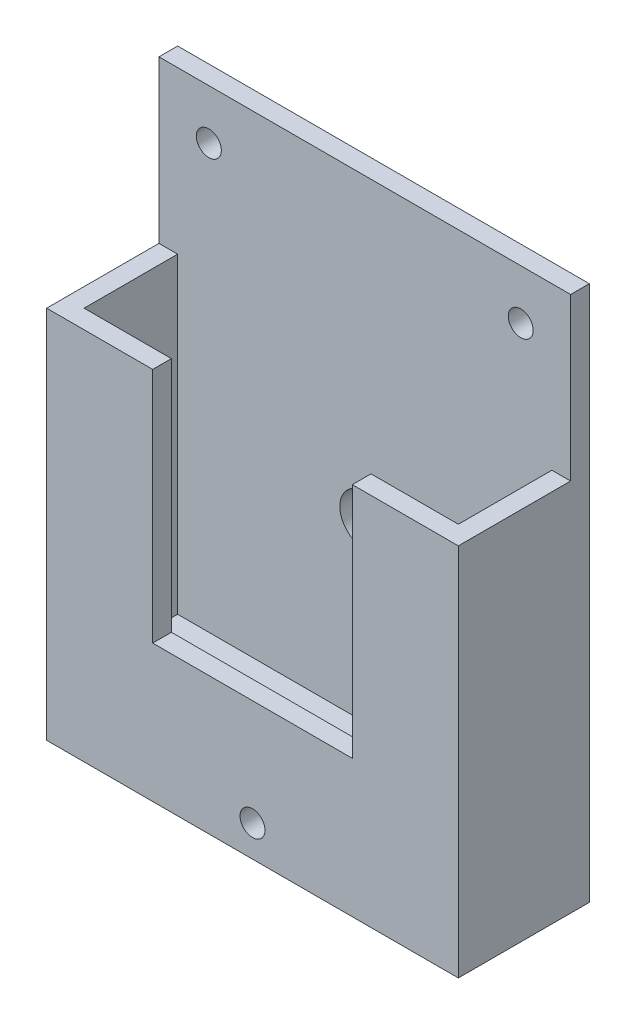
ISO-10303-21;
HEADER;
FILE_DESCRIPTION(('STEP AP214'),'2;1');
FILE_NAME('part.step','',(''),(''),'','','');
FILE_SCHEMA(('AUTOMOTIVE_DESIGN { 1 0 10303 214 1 1 1 1 }'));
ENDSEC;
DATA;
#1=APPLICATION_CONTEXT('core data for automotive mechanical design processes');
#2=APPLICATION_PROTOCOL_DEFINITION('international standard','automotive_design',2000,#1);
#3=PRODUCT_CONTEXT('',#1,'mechanical');
#4=PRODUCT('Part','Part','',(#3));
#5=PRODUCT_RELATED_PRODUCT_CATEGORY('part','',(#4));
#6=PRODUCT_DEFINITION_FORMATION('','',#4);
#7=PRODUCT_DEFINITION_CONTEXT('part definition',#1,'design');
#8=PRODUCT_DEFINITION('design','',#6,#7);
#9=PRODUCT_DEFINITION_SHAPE('','',#8);
#10=(LENGTH_UNIT() NAMED_UNIT(*) SI_UNIT(.MILLI.,.METRE.));
#11=(NAMED_UNIT(*) PLANE_ANGLE_UNIT() SI_UNIT($,.RADIAN.));
#12=(NAMED_UNIT(*) SI_UNIT($,.STERADIAN.) SOLID_ANGLE_UNIT());
#13=UNCERTAINTY_MEASURE_WITH_UNIT(LENGTH_MEASURE(1.E-05),#10,'distance_accuracy_value','');
#14=(GEOMETRIC_REPRESENTATION_CONTEXT(3) GLOBAL_UNCERTAINTY_ASSIGNED_CONTEXT((#13)) GLOBAL_UNIT_ASSIGNED_CONTEXT((#10,
#11,#12)) REPRESENTATION_CONTEXT('',''));
#15=CARTESIAN_POINT('',(0.,0.,0.));
#16=DIRECTION('',(0.,0.,1.));
#17=DIRECTION('',(1.,0.,0.));
#18=AXIS2_PLACEMENT_3D('',#15,#16,#17);
#19=CARTESIAN_POINT('',(-66.,-25.9,3.));
#20=DIRECTION('',(0.,1.,0.));
#21=DIRECTION('',(0.,0.,1.));
#22=AXIS2_PLACEMENT_3D('',#19,#20,#21);
#23=PLANE('',#22);
#24=DIRECTION('',(1.,0.,0.));
#25=VECTOR('',#24,1.);
#26=CARTESIAN_POINT('',(-66.,-25.9,21.));
#27=LINE('',#26,#25);
#28=CARTESIAN_POINT('',(-66.,-25.9,21.));
#29=VERTEX_POINT('',#28);
#30=CARTESIAN_POINT('',(-49.,-25.9,21.));
#31=VERTEX_POINT('',#30);
#32=EDGE_CURVE('E151',#29,#31,#27,.T.);
#33=ORIENTED_EDGE('',*,*,#32,.T.);
#34=DIRECTION('',(0.,0.,-1.));
#35=VECTOR('',#34,1.);
#36=CARTESIAN_POINT('',(-49.,-25.9,21.));
#37=LINE('',#36,#35);
#38=CARTESIAN_POINT('',(-49.,-25.9,18.));
#39=VERTEX_POINT('',#38);
#40=EDGE_CURVE('E133',#31,#39,#37,.T.);
#41=ORIENTED_EDGE('',*,*,#40,.T.);
#42=DIRECTION('',(1.,0.,0.));
#43=VECTOR('',#42,1.);
#44=CARTESIAN_POINT('',(-63.,-25.9,18.));
#45=LINE('',#44,#43);
#46=CARTESIAN_POINT('',(-63.,-25.9,18.));
#47=VERTEX_POINT('',#46);
#48=EDGE_CURVE('E249',#47,#39,#45,.T.);
#49=ORIENTED_EDGE('',*,*,#48,.F.);
#50=DIRECTION('',(0.,0.,1.));
#51=VECTOR('',#50,1.);
#52=CARTESIAN_POINT('',(-63.,-25.9,3.));
#53=LINE('',#52,#51);
#54=CARTESIAN_POINT('',(-63.,-25.9,3.));
#55=VERTEX_POINT('',#54);
#56=EDGE_CURVE('E258',#55,#47,#53,.T.);
#57=ORIENTED_EDGE('',*,*,#56,.F.);
#58=DIRECTION('',(1.,0.,0.));
#59=VECTOR('',#58,1.);
#60=CARTESIAN_POINT('',(-66.,-25.9,3.));
#61=LINE('',#60,#59);
#62=CARTESIAN_POINT('',(-66.,-25.9,3.));
#63=VERTEX_POINT('',#62);
#64=EDGE_CURVE('E164',#63,#55,#61,.T.);
#65=ORIENTED_EDGE('',*,*,#64,.F.);
#66=DIRECTION('',(0.,0.,1.));
#67=VECTOR('',#66,1.);
#68=CARTESIAN_POINT('',(-66.,-25.9,3.));
#69=LINE('',#68,#67);
#70=EDGE_CURVE('E158',#63,#29,#69,.T.);
#71=ORIENTED_EDGE('',*,*,#70,.T.);
#72=EDGE_LOOP('',(#33,#41,#49,#57,#65,#71));
#73=FACE_BOUND('',#72,.T.);
#74=ADVANCED_FACE('F32',(#73),#23,.T.);
#75=CARTESIAN_POINT('',(-17.,-25.9,18.));
#76=VERTEX_POINT('',#75);
#77=CARTESIAN_POINT('',(-3.,-25.9,18.));
#78=VERTEX_POINT('',#77);
#79=EDGE_CURVE('E272',#76,#78,#45,.T.);
#80=ORIENTED_EDGE('',*,*,#79,.F.);
#81=DIRECTION('',(0.,0.,-1.));
#82=VECTOR('',#81,1.);
#83=CARTESIAN_POINT('',(-17.,-25.9,21.));
#84=LINE('',#83,#82);
#85=CARTESIAN_POINT('',(-17.,-25.9,21.));
#86=VERTEX_POINT('',#85);
#87=EDGE_CURVE('E49',#86,#76,#84,.T.);
#88=ORIENTED_EDGE('',*,*,#87,.F.);
#89=CARTESIAN_POINT('',(0.,-25.9,21.));
#90=VERTEX_POINT('',#89);
#91=EDGE_CURVE('E160',#86,#90,#27,.T.);
#92=ORIENTED_EDGE('',*,*,#91,.T.);
#93=DIRECTION('',(0.,0.,1.));
#94=VECTOR('',#93,1.);
#95=CARTESIAN_POINT('',(0.,-25.9,3.));
#96=LINE('',#95,#94);
#97=CARTESIAN_POINT('',(0.,-25.9,3.));
#98=VERTEX_POINT('',#97);
#99=EDGE_CURVE('E207',#98,#90,#96,.T.);
#100=ORIENTED_EDGE('',*,*,#99,.F.);
#101=CARTESIAN_POINT('',(-3.,-25.9,3.));
#102=VERTEX_POINT('',#101);
#103=EDGE_CURVE('E169',#102,#98,#61,.T.);
#104=ORIENTED_EDGE('',*,*,#103,.F.);
#105=DIRECTION('',(0.,0.,1.));
#106=VECTOR('',#105,1.);
#107=CARTESIAN_POINT('',(-3.,-25.9,3.));
#108=LINE('',#107,#106);
#109=EDGE_CURVE('E144',#102,#78,#108,.T.);
#110=ORIENTED_EDGE('',*,*,#109,.T.);
#111=EDGE_LOOP('',(#80,#88,#92,#100,#104,#110));
#112=FACE_BOUND('',#111,.T.);
#113=ADVANCED_FACE('F290',(#112),#23,.T.);
#114=CARTESIAN_POINT('',(-66.,-25.9,21.));
#115=DIRECTION('',(0.,0.,1.));
#116=DIRECTION('',(0.,-1.,0.));
#117=AXIS2_PLACEMENT_3D('',#114,#115,#116);
#118=PLANE('',#117);
#119=CARTESIAN_POINT('',(-33.,-80.9,21.));
#120=DIRECTION('',(0.,0.,-1.));
#121=DIRECTION('',(-1.,0.,0.));
#122=AXIS2_PLACEMENT_3D('',#119,#120,#121);
#123=CIRCLE('',#122,2.);
#124=CARTESIAN_POINT('',(-35.,-80.9,21.));
#125=VERTEX_POINT('',#124);
#126=EDGE_CURVE('E421',#125,#125,#123,.T.);
#127=ORIENTED_EDGE('',*,*,#126,.T.);
#128=EDGE_LOOP('',(#127));
#129=FACE_BOUND('',#128,.T.);
#130=DIRECTION('',(1.,0.,0.));
#131=VECTOR('',#130,1.);
#132=CARTESIAN_POINT('',(-49.,-63.9,21.));
#133=LINE('',#132,#131);
#134=CARTESIAN_POINT('',(-49.,-63.9,21.));
#135=VERTEX_POINT('',#134);
#136=CARTESIAN_POINT('',(-17.,-63.9,21.));
#137=VERTEX_POINT('',#136);
#138=EDGE_CURVE('E154',#135,#137,#133,.T.);
#139=ORIENTED_EDGE('',*,*,#138,.F.);
#140=DIRECTION('',(0.,-1.,0.));
#141=VECTOR('',#140,1.);
#142=CARTESIAN_POINT('',(-49.,-25.9,21.));
#143=LINE('',#142,#141);
#144=EDGE_CURVE('E137',#31,#135,#143,.T.);
#145=ORIENTED_EDGE('',*,*,#144,.F.);
#146=ORIENTED_EDGE('',*,*,#32,.F.);
#147=DIRECTION('',(0.,-1.,0.));
#148=VECTOR('',#147,1.);
#149=CARTESIAN_POINT('',(-66.,-25.9,21.));
#150=LINE('',#149,#148);
#151=CARTESIAN_POINT('',(-66.,-85.9,21.));
#152=VERTEX_POINT('',#151);
#153=EDGE_CURVE('E253',#29,#152,#150,.T.);
#154=ORIENTED_EDGE('',*,*,#153,.T.);
#155=DIRECTION('',(1.,0.,0.));
#156=VECTOR('',#155,1.);
#157=CARTESIAN_POINT('',(-66.,-85.9,21.));
#158=LINE('',#157,#156);
#159=CARTESIAN_POINT('',(0.,-85.9,21.));
#160=VERTEX_POINT('',#159);
#161=EDGE_CURVE('E159',#152,#160,#158,.T.);
#162=ORIENTED_EDGE('',*,*,#161,.T.);
#163=DIRECTION('',(0.,-1.,0.));
#164=VECTOR('',#163,1.);
#165=CARTESIAN_POINT('',(0.,-25.9,21.));
#166=LINE('',#165,#164);
#167=EDGE_CURVE('E225',#90,#160,#166,.T.);
#168=ORIENTED_EDGE('',*,*,#167,.F.);
#169=ORIENTED_EDGE('',*,*,#91,.F.);
#170=DIRECTION('',(0.,1.,0.));
#171=VECTOR('',#170,1.);
#172=CARTESIAN_POINT('',(-17.,-63.9,21.));
#173=LINE('',#172,#171);
#174=EDGE_CURVE('E292',#137,#86,#173,.T.);
#175=ORIENTED_EDGE('',*,*,#174,.F.);
#176=EDGE_LOOP('',(#139,#145,#146,#154,#162,#168,#169,#175));
#177=FACE_BOUND('',#176,.T.);
#178=ADVANCED_FACE('F149',(#129,#177),#118,.T.);
#179=CARTESIAN_POINT('',(-63.,-25.9,18.));
#180=DIRECTION('',(0.,0.,1.));
#181=DIRECTION('',(0.,-1.,0.));
#182=AXIS2_PLACEMENT_3D('',#179,#180,#181);
#183=PLANE('',#182);
#184=DIRECTION('',(0.,1.,0.));
#185=VECTOR('',#184,1.);
#186=CARTESIAN_POINT('',(-49.,-25.9,18.));
#187=LINE('',#186,#185);
#188=CARTESIAN_POINT('',(-49.,-63.9,18.));
#189=VERTEX_POINT('',#188);
#190=EDGE_CURVE('E11',#189,#39,#187,.T.);
#191=ORIENTED_EDGE('',*,*,#190,.F.);
#192=DIRECTION('',(-1.,0.,0.));
#193=VECTOR('',#192,1.);
#194=CARTESIAN_POINT('',(-63.,-63.9,18.));
#195=LINE('',#194,#193);
#196=CARTESIAN_POINT('',(-17.,-63.9,18.));
#197=VERTEX_POINT('',#196);
#198=EDGE_CURVE('E41',#197,#189,#195,.T.);
#199=ORIENTED_EDGE('',*,*,#198,.F.);
#200=DIRECTION('',(0.,-1.,0.));
#201=VECTOR('',#200,1.);
#202=CARTESIAN_POINT('',(-17.,-25.9,18.));
#203=LINE('',#202,#201);
#204=EDGE_CURVE('E173',#76,#197,#203,.T.);
#205=ORIENTED_EDGE('',*,*,#204,.F.);
#206=ORIENTED_EDGE('',*,*,#79,.T.);
#207=DIRECTION('',(0.,-1.,0.));
#208=VECTOR('',#207,1.);
#209=CARTESIAN_POINT('',(-3.,-25.9,18.));
#210=LINE('',#209,#208);
#211=CARTESIAN_POINT('',(-3.,-75.9,18.));
#212=VERTEX_POINT('',#211);
#213=EDGE_CURVE('E275',#78,#212,#210,.T.);
#214=ORIENTED_EDGE('',*,*,#213,.T.);
#215=DIRECTION('',(1.,0.,0.));
#216=VECTOR('',#215,1.);
#217=CARTESIAN_POINT('',(-63.,-75.9,18.));
#218=LINE('',#217,#216);
#219=CARTESIAN_POINT('',(-63.,-75.9,18.));
#220=VERTEX_POINT('',#219);
#221=EDGE_CURVE('E219',#220,#212,#218,.T.);
#222=ORIENTED_EDGE('',*,*,#221,.F.);
#223=DIRECTION('',(0.,-1.,0.));
#224=VECTOR('',#223,1.);
#225=CARTESIAN_POINT('',(-63.,-25.9,18.));
#226=LINE('',#225,#224);
#227=EDGE_CURVE('E261',#47,#220,#226,.T.);
#228=ORIENTED_EDGE('',*,*,#227,.F.);
#229=ORIENTED_EDGE('',*,*,#48,.T.);
#230=EDGE_LOOP('',(#191,#199,#205,#206,#214,#222,#228,#229));
#231=FACE_BOUND('',#230,.T.);
#232=ADVANCED_FACE('F285',(#231),#183,.F.);
#233=CARTESIAN_POINT('',(-66.,0.,3.));
#234=DIRECTION('',(0.,1.,0.));
#235=DIRECTION('',(0.,0.,1.));
#236=AXIS2_PLACEMENT_3D('',#233,#234,#235);
#237=PLANE('',#236);
#238=DIRECTION('',(0.,0.,1.));
#239=VECTOR('',#238,1.);
#240=CARTESIAN_POINT('',(0.,0.,3.));
#241=LINE('',#240,#239);
#242=CARTESIAN_POINT('',(0.,0.,0.));
#243=VERTEX_POINT('',#242);
#244=CARTESIAN_POINT('',(0.,0.,3.));
#245=VERTEX_POINT('',#244);
#246=EDGE_CURVE('E208',#243,#245,#241,.T.);
#247=ORIENTED_EDGE('',*,*,#246,.F.);
#248=DIRECTION('',(1.,0.,0.));
#249=VECTOR('',#248,1.);
#250=CARTESIAN_POINT('',(-66.,0.,0.));
#251=LINE('',#250,#249);
#252=CARTESIAN_POINT('',(-66.,0.,0.));
#253=VERTEX_POINT('',#252);
#254=EDGE_CURVE('E175',#253,#243,#251,.T.);
#255=ORIENTED_EDGE('',*,*,#254,.F.);
#256=DIRECTION('',(0.,0.,1.));
#257=VECTOR('',#256,1.);
#258=CARTESIAN_POINT('',(-66.,0.,3.));
#259=LINE('',#258,#257);
#260=CARTESIAN_POINT('',(-66.,0.,3.));
#261=VERTEX_POINT('',#260);
#262=EDGE_CURVE('E231',#253,#261,#259,.T.);
#263=ORIENTED_EDGE('',*,*,#262,.T.);
#264=DIRECTION('',(1.,0.,0.));
#265=VECTOR('',#264,1.);
#266=CARTESIAN_POINT('',(-66.,0.,3.));
#267=LINE('',#266,#265);
#268=EDGE_CURVE('E170',#261,#245,#267,.T.);
#269=ORIENTED_EDGE('',*,*,#268,.T.);
#270=EDGE_LOOP('',(#247,#255,#263,#269));
#271=FACE_BOUND('',#270,.T.);
#272=ADVANCED_FACE('F34',(#271),#237,.T.);
#273=CARTESIAN_POINT('',(-66.,-85.9,0.));
#274=DIRECTION('',(0.,0.,-1.));
#275=DIRECTION('',(-1.,0.,0.));
#276=AXIS2_PLACEMENT_3D('',#273,#274,#275);
#277=PLANE('',#276);
#278=CARTESIAN_POINT('',(-8.,-8.00000000000001,0.));
#279=DIRECTION('',(0.,0.,-1.));
#280=DIRECTION('',(-1.,0.,0.));
#281=AXIS2_PLACEMENT_3D('',#278,#279,#280);
#282=CIRCLE('',#281,2.);
#283=CARTESIAN_POINT('',(-10.,-8.00000000000001,0.));
#284=VERTEX_POINT('',#283);
#285=EDGE_CURVE('E430',#284,#284,#282,.T.);
#286=ORIENTED_EDGE('',*,*,#285,.F.);
#287=EDGE_LOOP('',(#286));
#288=FACE_BOUND('',#287,.T.);
#289=CARTESIAN_POINT('',(-58.,-7.99999999999999,0.));
#290=DIRECTION('',(0.,0.,-1.));
#291=DIRECTION('',(-1.,0.,0.));
#292=AXIS2_PLACEMENT_3D('',#289,#290,#291);
#293=CIRCLE('',#292,2.);
#294=CARTESIAN_POINT('',(-60.,-7.99999999999999,0.));
#295=VERTEX_POINT('',#294);
#296=EDGE_CURVE('E426',#295,#295,#293,.T.);
#297=ORIENTED_EDGE('',*,*,#296,.F.);
#298=EDGE_LOOP('',(#297));
#299=FACE_BOUND('',#298,.T.);
#300=CARTESIAN_POINT('',(-33.,-80.9,0.));
#301=DIRECTION('',(0.,0.,-1.));
#302=DIRECTION('',(-1.,0.,0.));
#303=AXIS2_PLACEMENT_3D('',#300,#301,#302);
#304=CIRCLE('',#303,2.);
#305=CARTESIAN_POINT('',(-35.,-80.9,0.));
#306=VERTEX_POINT('',#305);
#307=EDGE_CURVE('E424',#306,#306,#304,.T.);
#308=ORIENTED_EDGE('',*,*,#307,.F.);
#309=EDGE_LOOP('',(#308));
#310=FACE_BOUND('',#309,.T.);
#311=CARTESIAN_POINT('',(-33.,-47.9,0.));
#312=DIRECTION('',(0.,0.,-1.));
#313=DIRECTION('',(-1.,0.,0.));
#314=AXIS2_PLACEMENT_3D('',#311,#312,#313);
#315=CIRCLE('',#314,4.);
#316=CARTESIAN_POINT('',(-37.,-47.9,0.));
#317=VERTEX_POINT('',#316);
#318=EDGE_CURVE('E180',#317,#317,#315,.T.);
#319=ORIENTED_EDGE('',*,*,#318,.F.);
#320=EDGE_LOOP('',(#319));
#321=FACE_BOUND('',#320,.T.);
#322=DIRECTION('',(0.,1.,0.));
#323=VECTOR('',#322,1.);
#324=CARTESIAN_POINT('',(0.,-85.9,0.));
#325=LINE('',#324,#323);
#326=CARTESIAN_POINT('',(0.,-85.9,0.));
#327=VERTEX_POINT('',#326);
#328=EDGE_CURVE('E215',#327,#243,#325,.T.);
#329=ORIENTED_EDGE('',*,*,#328,.F.);
#330=DIRECTION('',(1.,0.,0.));
#331=VECTOR('',#330,1.);
#332=CARTESIAN_POINT('',(-66.,-85.9,0.));
#333=LINE('',#332,#331);
#334=CARTESIAN_POINT('',(-66.,-85.9,0.));
#335=VERTEX_POINT('',#334);
#336=EDGE_CURVE('E162',#335,#327,#333,.T.);
#337=ORIENTED_EDGE('',*,*,#336,.F.);
#338=DIRECTION('',(0.,1.,0.));
#339=VECTOR('',#338,1.);
#340=CARTESIAN_POINT('',(-66.,-85.9,0.));
#341=LINE('',#340,#339);
#342=EDGE_CURVE('E172',#335,#253,#341,.T.);
#343=ORIENTED_EDGE('',*,*,#342,.T.);
#344=ORIENTED_EDGE('',*,*,#254,.T.);
#345=EDGE_LOOP('',(#329,#337,#343,#344));
#346=FACE_BOUND('',#345,.T.);
#347=ADVANCED_FACE('F241',(#288,#299,#310,#321,#346),#277,.T.);
#348=CARTESIAN_POINT('',(-66.,-85.9,21.));
#349=DIRECTION('',(0.,-1.,0.));
#350=DIRECTION('',(0.,0.,-1.));
#351=AXIS2_PLACEMENT_3D('',#348,#349,#350);
#352=PLANE('',#351);
#353=DIRECTION('',(0.,0.,-1.));
#354=VECTOR('',#353,1.);
#355=CARTESIAN_POINT('',(0.,-85.9,21.));
#356=LINE('',#355,#354);
#357=EDGE_CURVE('E228',#160,#327,#356,.T.);
#358=ORIENTED_EDGE('',*,*,#357,.F.);
#359=ORIENTED_EDGE('',*,*,#161,.F.);
#360=DIRECTION('',(0.,0.,-1.));
#361=VECTOR('',#360,1.);
#362=CARTESIAN_POINT('',(-66.,-85.9,21.));
#363=LINE('',#362,#361);
#364=EDGE_CURVE('E236',#152,#335,#363,.T.);
#365=ORIENTED_EDGE('',*,*,#364,.T.);
#366=ORIENTED_EDGE('',*,*,#336,.T.);
#367=EDGE_LOOP('',(#358,#359,#365,#366));
#368=FACE_BOUND('',#367,.T.);
#369=ADVANCED_FACE('F194',(#368),#352,.T.);
#370=CARTESIAN_POINT('',(-66.,-25.9,3.));
#371=DIRECTION('',(0.,0.,1.));
#372=DIRECTION('',(1.,0.,0.));
#373=AXIS2_PLACEMENT_3D('',#370,#371,#372);
#374=PLANE('',#373);
#375=CARTESIAN_POINT('',(-8.,-8.00000000000001,3.));
#376=DIRECTION('',(0.,0.,1.));
#377=DIRECTION('',(1.,0.,0.));
#378=AXIS2_PLACEMENT_3D('',#375,#376,#377);
#379=CIRCLE('',#378,2.);
#380=CARTESIAN_POINT('',(-6.,-8.00000000000001,3.));
#381=VERTEX_POINT('',#380);
#382=EDGE_CURVE('E36',#381,#381,#379,.T.);
#383=ORIENTED_EDGE('',*,*,#382,.F.);
#384=EDGE_LOOP('',(#383));
#385=FACE_BOUND('',#384,.T.);
#386=CARTESIAN_POINT('',(-58.,-7.99999999999999,3.));
#387=DIRECTION('',(0.,0.,1.));
#388=DIRECTION('',(1.,0.,0.));
#389=AXIS2_PLACEMENT_3D('',#386,#387,#388);
#390=CIRCLE('',#389,2.);
#391=CARTESIAN_POINT('',(-56.,-7.99999999999999,3.));
#392=VERTEX_POINT('',#391);
#393=EDGE_CURVE('E179',#392,#392,#390,.T.);
#394=ORIENTED_EDGE('',*,*,#393,.F.);
#395=EDGE_LOOP('',(#394));
#396=FACE_BOUND('',#395,.T.);
#397=CARTESIAN_POINT('',(-33.,-47.9,3.));
#398=DIRECTION('',(0.,0.,1.));
#399=DIRECTION('',(1.,0.,0.));
#400=AXIS2_PLACEMENT_3D('',#397,#398,#399);
#401=CIRCLE('',#400,4.);
#402=CARTESIAN_POINT('',(-29.,-47.9,3.));
#403=VERTEX_POINT('',#402);
#404=EDGE_CURVE('E177',#403,#403,#401,.T.);
#405=ORIENTED_EDGE('',*,*,#404,.F.);
#406=EDGE_LOOP('',(#405));
#407=FACE_BOUND('',#406,.T.);
#408=DIRECTION('',(0.,-1.,0.));
#409=VECTOR('',#408,1.);
#410=CARTESIAN_POINT('',(0.,-25.9,3.));
#411=LINE('',#410,#409);
#412=EDGE_CURVE('E199',#245,#98,#411,.T.);
#413=ORIENTED_EDGE('',*,*,#412,.F.);
#414=ORIENTED_EDGE('',*,*,#268,.F.);
#415=DIRECTION('',(0.,-1.,0.));
#416=VECTOR('',#415,1.);
#417=CARTESIAN_POINT('',(-66.,-25.9,3.));
#418=LINE('',#417,#416);
#419=EDGE_CURVE('E245',#261,#63,#418,.T.);
#420=ORIENTED_EDGE('',*,*,#419,.T.);
#421=ORIENTED_EDGE('',*,*,#64,.T.);
#422=DIRECTION('',(0.,1.,0.));
#423=VECTOR('',#422,1.);
#424=CARTESIAN_POINT('',(-63.,-75.9,3.));
#425=LINE('',#424,#423);
#426=CARTESIAN_POINT('',(-63.,-75.9,3.));
#427=VERTEX_POINT('',#426);
#428=EDGE_CURVE('E255',#427,#55,#425,.T.);
#429=ORIENTED_EDGE('',*,*,#428,.F.);
#430=DIRECTION('',(1.,0.,0.));
#431=VECTOR('',#430,1.);
#432=CARTESIAN_POINT('',(-63.,-75.9,3.));
#433=LINE('',#432,#431);
#434=CARTESIAN_POINT('',(-3.,-75.9,3.));
#435=VERTEX_POINT('',#434);
#436=EDGE_CURVE('E217',#427,#435,#433,.T.);
#437=ORIENTED_EDGE('',*,*,#436,.T.);
#438=DIRECTION('',(0.,1.,0.));
#439=VECTOR('',#438,1.);
#440=CARTESIAN_POINT('',(-3.,-75.9,3.));
#441=LINE('',#440,#439);
#442=EDGE_CURVE('E57',#435,#102,#441,.T.);
#443=ORIENTED_EDGE('',*,*,#442,.T.);
#444=ORIENTED_EDGE('',*,*,#103,.T.);
#445=EDGE_LOOP('',(#413,#414,#420,#421,#429,#437,#443,#444));
#446=FACE_BOUND('',#445,.T.);
#447=ADVANCED_FACE('F190',(#385,#396,#407,#446),#374,.T.);
#448=CARTESIAN_POINT('',(-66.,0.,0.));
#449=DIRECTION('',(1.,0.,0.));
#450=DIRECTION('',(0.,0.,-1.));
#451=AXIS2_PLACEMENT_3D('',#448,#449,#450);
#452=PLANE('',#451);
#453=ORIENTED_EDGE('',*,*,#262,.F.);
#454=ORIENTED_EDGE('',*,*,#342,.F.);
#455=ORIENTED_EDGE('',*,*,#364,.F.);
#456=ORIENTED_EDGE('',*,*,#153,.F.);
#457=ORIENTED_EDGE('',*,*,#70,.F.);
#458=ORIENTED_EDGE('',*,*,#419,.F.);
#459=EDGE_LOOP('',(#453,#454,#455,#456,#457,#458));
#460=FACE_BOUND('',#459,.T.);
#461=ADVANCED_FACE('F193',(#460),#452,.F.);
#462=CARTESIAN_POINT('',(0.,0.,0.));
#463=DIRECTION('',(1.,0.,0.));
#464=DIRECTION('',(0.,0.,-1.));
#465=AXIS2_PLACEMENT_3D('',#462,#463,#464);
#466=PLANE('',#465);
#467=ORIENTED_EDGE('',*,*,#246,.T.);
#468=ORIENTED_EDGE('',*,*,#412,.T.);
#469=ORIENTED_EDGE('',*,*,#99,.T.);
#470=ORIENTED_EDGE('',*,*,#167,.T.);
#471=ORIENTED_EDGE('',*,*,#357,.T.);
#472=ORIENTED_EDGE('',*,*,#328,.T.);
#473=EDGE_LOOP('',(#467,#468,#469,#470,#471,#472));
#474=FACE_BOUND('',#473,.T.);
#475=ADVANCED_FACE('F212',(#474),#466,.T.);
#476=CARTESIAN_POINT('',(-63.,-75.9,18.));
#477=DIRECTION('',(0.,-1.,0.));
#478=DIRECTION('',(0.,0.,-1.));
#479=AXIS2_PLACEMENT_3D('',#476,#477,#478);
#480=PLANE('',#479);
#481=DIRECTION('',(0.,0.,-1.));
#482=VECTOR('',#481,1.);
#483=CARTESIAN_POINT('',(-3.,-75.9,18.));
#484=LINE('',#483,#482);
#485=EDGE_CURVE('E265',#212,#435,#484,.T.);
#486=ORIENTED_EDGE('',*,*,#485,.T.);
#487=ORIENTED_EDGE('',*,*,#436,.F.);
#488=DIRECTION('',(0.,0.,-1.));
#489=VECTOR('',#488,1.);
#490=CARTESIAN_POINT('',(-63.,-75.9,18.));
#491=LINE('',#490,#489);
#492=EDGE_CURVE('E263',#220,#427,#491,.T.);
#493=ORIENTED_EDGE('',*,*,#492,.F.);
#494=ORIENTED_EDGE('',*,*,#221,.T.);
#495=EDGE_LOOP('',(#486,#487,#493,#494));
#496=FACE_BOUND('',#495,.T.);
#497=ADVANCED_FACE('F330',(#496),#480,.F.);
#498=CARTESIAN_POINT('',(-63.,0.,0.));
#499=DIRECTION('',(1.,0.,0.));
#500=DIRECTION('',(0.,0.,-1.));
#501=AXIS2_PLACEMENT_3D('',#498,#499,#500);
#502=PLANE('',#501);
#503=ORIENTED_EDGE('',*,*,#56,.T.);
#504=ORIENTED_EDGE('',*,*,#227,.T.);
#505=ORIENTED_EDGE('',*,*,#492,.T.);
#506=ORIENTED_EDGE('',*,*,#428,.T.);
#507=EDGE_LOOP('',(#503,#504,#505,#506));
#508=FACE_BOUND('',#507,.T.);
#509=ADVANCED_FACE('F337',(#508),#502,.T.);
#510=CARTESIAN_POINT('',(-3.,0.,0.));
#511=DIRECTION('',(1.,0.,0.));
#512=DIRECTION('',(0.,0.,-1.));
#513=AXIS2_PLACEMENT_3D('',#510,#511,#512);
#514=PLANE('',#513);
#515=ORIENTED_EDGE('',*,*,#109,.F.);
#516=ORIENTED_EDGE('',*,*,#442,.F.);
#517=ORIENTED_EDGE('',*,*,#485,.F.);
#518=ORIENTED_EDGE('',*,*,#213,.F.);
#519=EDGE_LOOP('',(#515,#516,#517,#518));
#520=FACE_BOUND('',#519,.T.);
#521=ADVANCED_FACE('F289',(#520),#514,.F.);
#522=CARTESIAN_POINT('',(-49.,-25.9,21.));
#523=DIRECTION('',(1.,0.,0.));
#524=DIRECTION('',(0.,1.,0.));
#525=AXIS2_PLACEMENT_3D('',#522,#523,#524);
#526=PLANE('',#525);
#527=ORIENTED_EDGE('',*,*,#190,.T.);
#528=ORIENTED_EDGE('',*,*,#40,.F.);
#529=ORIENTED_EDGE('',*,*,#144,.T.);
#530=DIRECTION('',(0.,0.,-1.));
#531=VECTOR('',#530,1.);
#532=CARTESIAN_POINT('',(-49.,-63.9,21.));
#533=LINE('',#532,#531);
#534=EDGE_CURVE('E145',#135,#189,#533,.T.);
#535=ORIENTED_EDGE('',*,*,#534,.T.);
#536=EDGE_LOOP('',(#527,#528,#529,#535));
#537=FACE_BOUND('',#536,.T.);
#538=ADVANCED_FACE('F135',(#537),#526,.T.);
#539=CARTESIAN_POINT('',(-49.,-63.9,21.));
#540=DIRECTION('',(0.,1.,0.));
#541=DIRECTION('',(0.,0.,1.));
#542=AXIS2_PLACEMENT_3D('',#539,#540,#541);
#543=PLANE('',#542);
#544=ORIENTED_EDGE('',*,*,#198,.T.);
#545=ORIENTED_EDGE('',*,*,#534,.F.);
#546=ORIENTED_EDGE('',*,*,#138,.T.);
#547=DIRECTION('',(0.,0.,-1.));
#548=VECTOR('',#547,1.);
#549=CARTESIAN_POINT('',(-17.,-63.9,21.));
#550=LINE('',#549,#548);
#551=EDGE_CURVE('E295',#137,#197,#550,.T.);
#552=ORIENTED_EDGE('',*,*,#551,.T.);
#553=EDGE_LOOP('',(#544,#545,#546,#552));
#554=FACE_BOUND('',#553,.T.);
#555=ADVANCED_FACE('F301',(#554),#543,.T.);
#556=CARTESIAN_POINT('',(-17.,-63.9,21.));
#557=DIRECTION('',(-1.,0.,0.));
#558=DIRECTION('',(0.,0.,1.));
#559=AXIS2_PLACEMENT_3D('',#556,#557,#558);
#560=PLANE('',#559);
#561=ORIENTED_EDGE('',*,*,#204,.T.);
#562=ORIENTED_EDGE('',*,*,#551,.F.);
#563=ORIENTED_EDGE('',*,*,#174,.T.);
#564=ORIENTED_EDGE('',*,*,#87,.T.);
#565=EDGE_LOOP('',(#561,#562,#563,#564));
#566=FACE_BOUND('',#565,.T.);
#567=ADVANCED_FACE('F302',(#566),#560,.T.);
#568=CARTESIAN_POINT('',(-33.,-47.9,21.));
#569=DIRECTION('',(0.,0.,-1.));
#570=DIRECTION('',(-1.,0.,0.));
#571=AXIS2_PLACEMENT_3D('',#568,#569,#570);
#572=CYLINDRICAL_SURFACE('',#571,4.);
#573=ORIENTED_EDGE('',*,*,#404,.T.);
#574=EDGE_LOOP('',(#573));
#575=FACE_BOUND('',#574,.T.);
#576=ORIENTED_EDGE('',*,*,#318,.T.);
#577=EDGE_LOOP('',(#576));
#578=FACE_BOUND('',#577,.T.);
#579=ADVANCED_FACE('F304',(#575,#578),#572,.F.);
#580=CARTESIAN_POINT('',(-58.,-7.99999999999999,21.));
#581=DIRECTION('',(0.,0.,-1.));
#582=DIRECTION('',(-1.,0.,0.));
#583=AXIS2_PLACEMENT_3D('',#580,#581,#582);
#584=CYLINDRICAL_SURFACE('',#583,2.);
#585=ORIENTED_EDGE('',*,*,#393,.T.);
#586=EDGE_LOOP('',(#585));
#587=FACE_BOUND('',#586,.T.);
#588=ORIENTED_EDGE('',*,*,#296,.T.);
#589=EDGE_LOOP('',(#588));
#590=FACE_BOUND('',#589,.T.);
#591=ADVANCED_FACE('F310',(#587,#590),#584,.F.);
#592=CARTESIAN_POINT('',(-8.,-8.00000000000001,21.));
#593=DIRECTION('',(0.,0.,-1.));
#594=DIRECTION('',(-1.,0.,0.));
#595=AXIS2_PLACEMENT_3D('',#592,#593,#594);
#596=CYLINDRICAL_SURFACE('',#595,2.);
#597=ORIENTED_EDGE('',*,*,#382,.T.);
#598=EDGE_LOOP('',(#597));
#599=FACE_BOUND('',#598,.T.);
#600=ORIENTED_EDGE('',*,*,#285,.T.);
#601=EDGE_LOOP('',(#600));
#602=FACE_BOUND('',#601,.T.);
#603=ADVANCED_FACE('F187',(#599,#602),#596,.F.);
#604=CARTESIAN_POINT('',(-33.,-80.9,21.));
#605=DIRECTION('',(0.,0.,-1.));
#606=DIRECTION('',(-1.,0.,0.));
#607=AXIS2_PLACEMENT_3D('',#604,#605,#606);
#608=CYLINDRICAL_SURFACE('',#607,2.);
#609=ORIENTED_EDGE('',*,*,#126,.F.);
#610=EDGE_LOOP('',(#609));
#611=FACE_BOUND('',#610,.T.);
#612=ORIENTED_EDGE('',*,*,#307,.T.);
#613=EDGE_LOOP('',(#612));
#614=FACE_BOUND('',#613,.T.);
#615=ADVANCED_FACE('F405',(#611,#614),#608,.F.);
#616=CLOSED_SHELL('',(#74,#113,#178,#232,#272,#347,#369,#447,#461,#475,#497,#509,#521,#538,#555,
#567,#579,#591,#603,#615));
#617=MANIFOLD_SOLID_BREP('B2',#616);
#618=ADVANCED_BREP_SHAPE_REPRESENTATION('',(#18,#617),#14);
#619=SHAPE_DEFINITION_REPRESENTATION(#9,#618);
ENDSEC;
END-ISO-10303-21;
